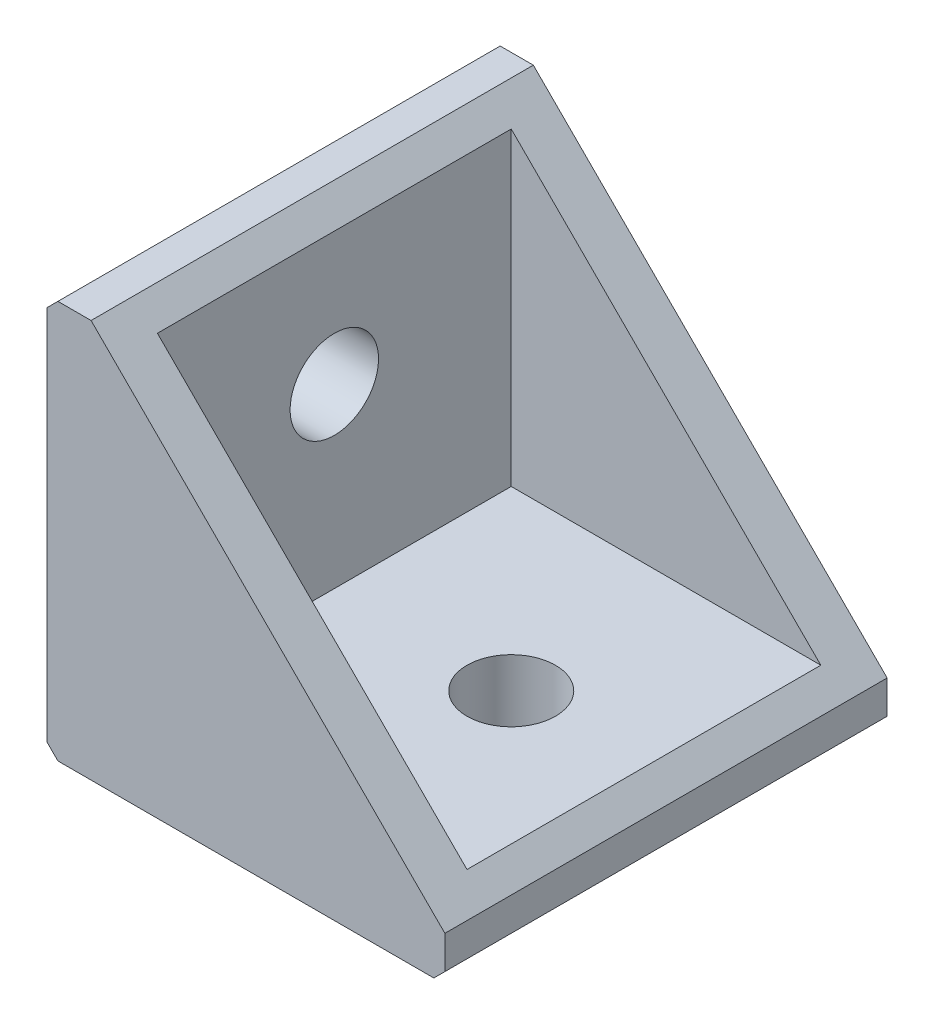
ISO-10303-21;
HEADER;
FILE_DESCRIPTION(('STEP AP214'),'2;1');
FILE_NAME('part.step','',(''),(''),'','','');
FILE_SCHEMA(('AUTOMOTIVE_DESIGN { 1 0 10303 214 1 1 1 1 }'));
ENDSEC;
DATA;
#1=APPLICATION_CONTEXT('core data for automotive mechanical design processes');
#2=APPLICATION_PROTOCOL_DEFINITION('international standard','automotive_design',2000,#1);
#3=PRODUCT_CONTEXT('',#1,'mechanical');
#4=PRODUCT('Part','Part','',(#3));
#5=PRODUCT_RELATED_PRODUCT_CATEGORY('part','',(#4));
#6=PRODUCT_DEFINITION_FORMATION('','',#4);
#7=PRODUCT_DEFINITION_CONTEXT('part definition',#1,'design');
#8=PRODUCT_DEFINITION('design','',#6,#7);
#9=PRODUCT_DEFINITION_SHAPE('','',#8);
#10=(LENGTH_UNIT() NAMED_UNIT(*) SI_UNIT(.MILLI.,.METRE.));
#11=(NAMED_UNIT(*) PLANE_ANGLE_UNIT() SI_UNIT($,.RADIAN.));
#12=(NAMED_UNIT(*) SI_UNIT($,.STERADIAN.) SOLID_ANGLE_UNIT());
#13=UNCERTAINTY_MEASURE_WITH_UNIT(LENGTH_MEASURE(1.E-05),#10,'distance_accuracy_value','');
#14=(GEOMETRIC_REPRESENTATION_CONTEXT(3) GLOBAL_UNCERTAINTY_ASSIGNED_CONTEXT((#13)) GLOBAL_UNIT_ASSIGNED_CONTEXT((#10,
#11,#12)) REPRESENTATION_CONTEXT('',''));
#15=CARTESIAN_POINT('',(0.,0.,0.));
#16=DIRECTION('',(0.,0.,1.));
#17=DIRECTION('',(1.,0.,0.));
#18=AXIS2_PLACEMENT_3D('',#15,#16,#17);
#19=CARTESIAN_POINT('',(2.,18.,0.));
#20=DIRECTION('',(-0.707106781186548,-0.707106781186548,0.));
#21=DIRECTION('',(0.707106781186548,-0.707106781186548,0.));
#22=AXIS2_PLACEMENT_3D('',#19,#20,#21);
#23=PLANE('',#22);
#24=DIRECTION('',(0.707106781186548,-0.707106781186548,0.));
#25=VECTOR('',#24,1.);
#26=CARTESIAN_POINT('',(2.,18.,20.));
#27=LINE('',#26,#25);
#28=CARTESIAN_POINT('',(2.,18.,20.));
#29=VERTEX_POINT('',#28);
#30=CARTESIAN_POINT('',(18.,2.,20.));
#31=VERTEX_POINT('',#30);
#32=EDGE_CURVE('E148',#29,#31,#27,.T.);
#33=ORIENTED_EDGE('',*,*,#32,.T.);
#34=DIRECTION('',(0.,0.,1.));
#35=VECTOR('',#34,1.);
#36=CARTESIAN_POINT('',(18.,2.,0.));
#37=LINE('',#36,#35);
#38=CARTESIAN_POINT('',(18.,1.99999999999999,0.));
#39=VERTEX_POINT('',#38);
#40=EDGE_CURVE('E151',#39,#31,#37,.T.);
#41=ORIENTED_EDGE('',*,*,#40,.F.);
#42=DIRECTION('',(0.707106781186548,-0.707106781186548,0.));
#43=VECTOR('',#42,1.);
#44=CARTESIAN_POINT('',(2.,18.,0.));
#45=LINE('',#44,#43);
#46=CARTESIAN_POINT('',(2.,18.,0.));
#47=VERTEX_POINT('',#46);
#48=EDGE_CURVE('E144',#47,#39,#45,.T.);
#49=ORIENTED_EDGE('',*,*,#48,.F.);
#50=DIRECTION('',(0.,0.,1.));
#51=VECTOR('',#50,1.);
#52=CARTESIAN_POINT('',(2.,18.,0.));
#53=LINE('',#52,#51);
#54=EDGE_CURVE('E147',#47,#29,#53,.T.);
#55=ORIENTED_EDGE('',*,*,#54,.T.);
#56=EDGE_LOOP('',(#33,#41,#49,#55));
#57=FACE_BOUND('',#56,.T.);
#58=DIRECTION('',(-0.707106781186547,0.707106781186548,0.));
#59=VECTOR('',#58,1.);
#60=CARTESIAN_POINT('',(17.,3.,2.));
#61=LINE('',#60,#59);
#62=CARTESIAN_POINT('',(17.,3.,2.));
#63=VERTEX_POINT('',#62);
#64=CARTESIAN_POINT('',(3.,17.,2.));
#65=VERTEX_POINT('',#64);
#66=EDGE_CURVE('E129',#63,#65,#61,.T.);
#67=ORIENTED_EDGE('',*,*,#66,.F.);
#68=DIRECTION('',(0.,0.,1.));
#69=VECTOR('',#68,1.);
#70=CARTESIAN_POINT('',(17.,3.,2.));
#71=LINE('',#70,#69);
#72=CARTESIAN_POINT('',(17.,3.,18.));
#73=VERTEX_POINT('',#72);
#74=EDGE_CURVE('E139',#63,#73,#71,.T.);
#75=ORIENTED_EDGE('',*,*,#74,.T.);
#76=DIRECTION('',(-0.707106781186547,0.707106781186548,0.));
#77=VECTOR('',#76,1.);
#78=CARTESIAN_POINT('',(17.,3.,18.));
#79=LINE('',#78,#77);
#80=CARTESIAN_POINT('',(3.,17.,18.));
#81=VERTEX_POINT('',#80);
#82=EDGE_CURVE('E137',#73,#81,#79,.T.);
#83=ORIENTED_EDGE('',*,*,#82,.T.);
#84=DIRECTION('',(0.,0.,1.));
#85=VECTOR('',#84,1.);
#86=CARTESIAN_POINT('',(3.,17.,2.));
#87=LINE('',#86,#85);
#88=EDGE_CURVE('E122',#65,#81,#87,.T.);
#89=ORIENTED_EDGE('',*,*,#88,.F.);
#90=EDGE_LOOP('',(#67,#75,#83,#89));
#91=FACE_BOUND('',#90,.T.);
#92=ADVANCED_FACE('F33',(#57,#91),#23,.F.);
#93=CARTESIAN_POINT('',(0.,0.,20.));
#94=DIRECTION('',(1.,0.,0.));
#95=DIRECTION('',(0.,0.,-1.));
#96=AXIS2_PLACEMENT_3D('',#93,#94,#95);
#97=PLANE('',#96);
#98=CARTESIAN_POINT('',(0.,11.,10.));
#99=DIRECTION('',(1.,0.,0.));
#100=DIRECTION('',(0.,1.,0.));
#101=AXIS2_PLACEMENT_3D('',#98,#99,#100);
#102=CIRCLE('',#101,2.);
#103=CARTESIAN_POINT('',(0.,13.,10.));
#104=VERTEX_POINT('',#103);
#105=EDGE_CURVE('E266',#104,#104,#102,.T.);
#106=ORIENTED_EDGE('',*,*,#105,.T.);
#107=EDGE_LOOP('',(#106));
#108=FACE_BOUND('',#107,.T.);
#109=DIRECTION('',(0.,-1.,0.));
#110=VECTOR('',#109,1.);
#111=CARTESIAN_POINT('',(0.,0.,0.));
#112=LINE('',#111,#110);
#113=CARTESIAN_POINT('',(0.,17.5,0.));
#114=VERTEX_POINT('',#113);
#115=CARTESIAN_POINT('',(0.,0.500000000000011,0.));
#116=VERTEX_POINT('',#115);
#117=EDGE_CURVE('E154',#114,#116,#112,.T.);
#118=ORIENTED_EDGE('',*,*,#117,.T.);
#119=DIRECTION('',(0.,0.,1.));
#120=VECTOR('',#119,1.);
#121=CARTESIAN_POINT('',(0.,0.500000000000011,20.));
#122=LINE('',#121,#120);
#123=CARTESIAN_POINT('',(0.,0.500000000000011,20.));
#124=VERTEX_POINT('',#123);
#125=EDGE_CURVE('E188',#116,#124,#122,.T.);
#126=ORIENTED_EDGE('',*,*,#125,.T.);
#127=DIRECTION('',(0.,-1.,0.));
#128=VECTOR('',#127,1.);
#129=CARTESIAN_POINT('',(0.,0.,20.));
#130=LINE('',#129,#128);
#131=CARTESIAN_POINT('',(0.,17.5,20.));
#132=VERTEX_POINT('',#131);
#133=EDGE_CURVE('E156',#132,#124,#130,.T.);
#134=ORIENTED_EDGE('',*,*,#133,.F.);
#135=DIRECTION('',(0.,0.,-1.));
#136=VECTOR('',#135,1.);
#137=CARTESIAN_POINT('',(0.,17.5,20.));
#138=LINE('',#137,#136);
#139=EDGE_CURVE('E185',#132,#114,#138,.T.);
#140=ORIENTED_EDGE('',*,*,#139,.T.);
#141=EDGE_LOOP('',(#118,#126,#134,#140));
#142=FACE_BOUND('',#141,.T.);
#143=ADVANCED_FACE('F216',(#108,#142),#97,.F.);
#144=CARTESIAN_POINT('',(0.,0.,20.));
#145=DIRECTION('',(0.,1.,0.));
#146=DIRECTION('',(0.,0.,1.));
#147=AXIS2_PLACEMENT_3D('',#144,#145,#146);
#148=PLANE('',#147);
#149=CARTESIAN_POINT('',(11.,0.,10.));
#150=DIRECTION('',(0.,1.,0.));
#151=DIRECTION('',(0.,0.,1.));
#152=AXIS2_PLACEMENT_3D('',#149,#150,#151);
#153=CIRCLE('',#152,2.);
#154=CARTESIAN_POINT('',(11.,0.,12.));
#155=VERTEX_POINT('',#154);
#156=EDGE_CURVE('E260',#155,#155,#153,.T.);
#157=ORIENTED_EDGE('',*,*,#156,.T.);
#158=EDGE_LOOP('',(#157));
#159=FACE_BOUND('',#158,.T.);
#160=DIRECTION('',(1.,0.,0.));
#161=VECTOR('',#160,1.);
#162=CARTESIAN_POINT('',(0.,0.,20.));
#163=LINE('',#162,#161);
#164=CARTESIAN_POINT('',(0.500000000000007,0.,20.));
#165=VERTEX_POINT('',#164);
#166=CARTESIAN_POINT('',(17.5,0.,20.));
#167=VERTEX_POINT('',#166);
#168=EDGE_CURVE('E159',#165,#167,#163,.T.);
#169=ORIENTED_EDGE('',*,*,#168,.F.);
#170=DIRECTION('',(0.,0.,-1.));
#171=VECTOR('',#170,1.);
#172=CARTESIAN_POINT('',(0.500000000000007,0.,20.));
#173=LINE('',#172,#171);
#174=CARTESIAN_POINT('',(0.500000000000007,0.,0.));
#175=VERTEX_POINT('',#174);
#176=EDGE_CURVE('E176',#165,#175,#173,.T.);
#177=ORIENTED_EDGE('',*,*,#176,.T.);
#178=DIRECTION('',(1.,0.,0.));
#179=VECTOR('',#178,1.);
#180=CARTESIAN_POINT('',(0.,0.,0.));
#181=LINE('',#180,#179);
#182=CARTESIAN_POINT('',(17.5,0.,0.));
#183=VERTEX_POINT('',#182);
#184=EDGE_CURVE('E169',#175,#183,#181,.T.);
#185=ORIENTED_EDGE('',*,*,#184,.T.);
#186=DIRECTION('',(0.,0.,1.));
#187=VECTOR('',#186,1.);
#188=CARTESIAN_POINT('',(17.5,0.,20.));
#189=LINE('',#188,#187);
#190=EDGE_CURVE('E166',#183,#167,#189,.T.);
#191=ORIENTED_EDGE('',*,*,#190,.T.);
#192=EDGE_LOOP('',(#169,#177,#185,#191));
#193=FACE_BOUND('',#192,.T.);
#194=ADVANCED_FACE('F224',(#159,#193),#148,.F.);
#195=CARTESIAN_POINT('',(18.,0.,20.));
#196=DIRECTION('',(-1.,0.,0.));
#197=DIRECTION('',(0.,0.,1.));
#198=AXIS2_PLACEMENT_3D('',#195,#196,#197);
#199=PLANE('',#198);
#200=DIRECTION('',(0.,1.,0.));
#201=VECTOR('',#200,1.);
#202=CARTESIAN_POINT('',(18.,0.,20.));
#203=LINE('',#202,#201);
#204=CARTESIAN_POINT('',(18.,0.500000000000007,20.));
#205=VERTEX_POINT('',#204);
#206=EDGE_CURVE('E162',#205,#31,#203,.T.);
#207=ORIENTED_EDGE('',*,*,#206,.F.);
#208=DIRECTION('',(0.,0.,-1.));
#209=VECTOR('',#208,1.);
#210=CARTESIAN_POINT('',(18.,0.500000000000007,20.));
#211=LINE('',#210,#209);
#212=CARTESIAN_POINT('',(18.,0.500000000000011,0.));
#213=VERTEX_POINT('',#212);
#214=EDGE_CURVE('E41',#205,#213,#211,.T.);
#215=ORIENTED_EDGE('',*,*,#214,.T.);
#216=DIRECTION('',(0.,1.,0.));
#217=VECTOR('',#216,1.);
#218=CARTESIAN_POINT('',(18.,0.,0.));
#219=LINE('',#218,#217);
#220=EDGE_CURVE('E172',#213,#39,#219,.T.);
#221=ORIENTED_EDGE('',*,*,#220,.T.);
#222=ORIENTED_EDGE('',*,*,#40,.T.);
#223=EDGE_LOOP('',(#207,#215,#221,#222));
#224=FACE_BOUND('',#223,.T.);
#225=ADVANCED_FACE('F198',(#224),#199,.F.);
#226=CARTESIAN_POINT('',(0.,18.,20.));
#227=DIRECTION('',(0.,-1.,0.));
#228=DIRECTION('',(0.,0.,-1.));
#229=AXIS2_PLACEMENT_3D('',#226,#227,#228);
#230=PLANE('',#229);
#231=DIRECTION('',(-1.,0.,0.));
#232=VECTOR('',#231,1.);
#233=CARTESIAN_POINT('',(0.,18.,0.));
#234=LINE('',#233,#232);
#235=CARTESIAN_POINT('',(0.500000000000004,18.,0.));
#236=VERTEX_POINT('',#235);
#237=EDGE_CURVE('E160',#47,#236,#234,.T.);
#238=ORIENTED_EDGE('',*,*,#237,.T.);
#239=DIRECTION('',(0.,0.,1.));
#240=VECTOR('',#239,1.);
#241=CARTESIAN_POINT('',(0.500000000000004,18.,20.));
#242=LINE('',#241,#240);
#243=CARTESIAN_POINT('',(0.500000000000004,18.,20.));
#244=VERTEX_POINT('',#243);
#245=EDGE_CURVE('E11',#236,#244,#242,.T.);
#246=ORIENTED_EDGE('',*,*,#245,.T.);
#247=DIRECTION('',(-1.,0.,0.));
#248=VECTOR('',#247,1.);
#249=CARTESIAN_POINT('',(0.,18.,20.));
#250=LINE('',#249,#248);
#251=EDGE_CURVE('E164',#29,#244,#250,.T.);
#252=ORIENTED_EDGE('',*,*,#251,.F.);
#253=ORIENTED_EDGE('',*,*,#54,.F.);
#254=EDGE_LOOP('',(#238,#246,#252,#253));
#255=FACE_BOUND('',#254,.T.);
#256=ADVANCED_FACE('F208',(#255),#230,.F.);
#257=CARTESIAN_POINT('',(0.,0.,20.));
#258=DIRECTION('',(0.,0.,-1.));
#259=DIRECTION('',(-1.,0.,0.));
#260=AXIS2_PLACEMENT_3D('',#257,#258,#259);
#261=PLANE('',#260);
#262=ORIENTED_EDGE('',*,*,#133,.T.);
#263=DIRECTION('',(-0.707106781186545,0.70710678118655,0.));
#264=VECTOR('',#263,1.);
#265=CARTESIAN_POINT('',(0.500000000000007,0.,20.));
#266=LINE('',#265,#264);
#267=EDGE_CURVE('E193',#124,#165,#266,.F.);
#268=ORIENTED_EDGE('',*,*,#267,.T.);
#269=ORIENTED_EDGE('',*,*,#168,.T.);
#270=DIRECTION('',(-0.70710678118655,-0.707106781186545,0.));
#271=VECTOR('',#270,1.);
#272=CARTESIAN_POINT('',(18.,0.500000000000007,20.));
#273=LINE('',#272,#271);
#274=EDGE_CURVE('E54',#167,#205,#273,.F.);
#275=ORIENTED_EDGE('',*,*,#274,.T.);
#276=ORIENTED_EDGE('',*,*,#206,.T.);
#277=ORIENTED_EDGE('',*,*,#32,.F.);
#278=ORIENTED_EDGE('',*,*,#251,.T.);
#279=DIRECTION('',(0.707106781186552,0.707106781186543,0.));
#280=VECTOR('',#279,1.);
#281=CARTESIAN_POINT('',(0.,17.5,20.));
#282=LINE('',#281,#280);
#283=EDGE_CURVE('E190',#244,#132,#282,.F.);
#284=ORIENTED_EDGE('',*,*,#283,.T.);
#285=EDGE_LOOP('',(#262,#268,#269,#275,#276,#277,#278,#284));
#286=FACE_BOUND('',#285,.T.);
#287=ADVANCED_FACE('F210',(#286),#261,.F.);
#288=CARTESIAN_POINT('',(0.,0.,0.));
#289=DIRECTION('',(0.,0.,-1.));
#290=DIRECTION('',(-1.,0.,0.));
#291=AXIS2_PLACEMENT_3D('',#288,#289,#290);
#292=PLANE('',#291);
#293=ORIENTED_EDGE('',*,*,#184,.F.);
#294=DIRECTION('',(0.707106781186545,-0.70710678118655,0.));
#295=VECTOR('',#294,1.);
#296=CARTESIAN_POINT('',(0.250000000000005,0.250000000000004,0.));
#297=LINE('',#296,#295);
#298=EDGE_CURVE('E183',#175,#116,#297,.F.);
#299=ORIENTED_EDGE('',*,*,#298,.T.);
#300=ORIENTED_EDGE('',*,*,#117,.F.);
#301=DIRECTION('',(-0.707106781186552,-0.707106781186543,0.));
#302=VECTOR('',#301,1.);
#303=CARTESIAN_POINT('',(-8.75,8.75000000000012,0.));
#304=LINE('',#303,#302);
#305=EDGE_CURVE('E179',#114,#236,#304,.F.);
#306=ORIENTED_EDGE('',*,*,#305,.T.);
#307=ORIENTED_EDGE('',*,*,#237,.F.);
#308=ORIENTED_EDGE('',*,*,#48,.T.);
#309=ORIENTED_EDGE('',*,*,#220,.F.);
#310=DIRECTION('',(0.70710678118655,0.707106781186545,0.));
#311=VECTOR('',#310,1.);
#312=CARTESIAN_POINT('',(8.74999999999993,-8.74999999999999,0.));
#313=LINE('',#312,#311);
#314=EDGE_CURVE('E181',#213,#183,#313,.F.);
#315=ORIENTED_EDGE('',*,*,#314,.T.);
#316=EDGE_LOOP('',(#293,#299,#300,#306,#307,#308,#309,#315));
#317=FACE_BOUND('',#316,.T.);
#318=ADVANCED_FACE('F203',(#317),#292,.T.);
#319=CARTESIAN_POINT('',(3.,3.,2.));
#320=DIRECTION('',(0.,-1.,0.));
#321=DIRECTION('',(0.,0.,-1.));
#322=AXIS2_PLACEMENT_3D('',#319,#320,#321);
#323=PLANE('',#322);
#324=CARTESIAN_POINT('',(11.,3.,10.));
#325=DIRECTION('',(0.,1.,0.));
#326=DIRECTION('',(0.,0.,1.));
#327=AXIS2_PLACEMENT_3D('',#324,#325,#326);
#328=CIRCLE('',#327,2.);
#329=CARTESIAN_POINT('',(11.,3.,12.));
#330=VERTEX_POINT('',#329);
#331=EDGE_CURVE('E263',#330,#330,#328,.T.);
#332=ORIENTED_EDGE('',*,*,#331,.F.);
#333=EDGE_LOOP('',(#332));
#334=FACE_BOUND('',#333,.T.);
#335=DIRECTION('',(1.,0.,0.));
#336=VECTOR('',#335,1.);
#337=CARTESIAN_POINT('',(3.,3.,18.));
#338=LINE('',#337,#336);
#339=CARTESIAN_POINT('',(3.,3.,18.));
#340=VERTEX_POINT('',#339);
#341=EDGE_CURVE('E135',#340,#73,#338,.T.);
#342=ORIENTED_EDGE('',*,*,#341,.T.);
#343=ORIENTED_EDGE('',*,*,#74,.F.);
#344=DIRECTION('',(1.,0.,0.));
#345=VECTOR('',#344,1.);
#346=CARTESIAN_POINT('',(3.,3.,2.));
#347=LINE('',#346,#345);
#348=CARTESIAN_POINT('',(3.,3.,2.));
#349=VERTEX_POINT('',#348);
#350=EDGE_CURVE('E128',#349,#63,#347,.T.);
#351=ORIENTED_EDGE('',*,*,#350,.F.);
#352=DIRECTION('',(0.,0.,1.));
#353=VECTOR('',#352,1.);
#354=CARTESIAN_POINT('',(3.,3.,2.));
#355=LINE('',#354,#353);
#356=EDGE_CURVE('E124',#349,#340,#355,.T.);
#357=ORIENTED_EDGE('',*,*,#356,.T.);
#358=EDGE_LOOP('',(#342,#343,#351,#357));
#359=FACE_BOUND('',#358,.T.);
#360=ADVANCED_FACE('F249',(#334,#359),#323,.F.);
#361=CARTESIAN_POINT('',(3.,17.,2.));
#362=DIRECTION('',(-1.,0.,0.));
#363=DIRECTION('',(0.,-1.,0.));
#364=AXIS2_PLACEMENT_3D('',#361,#362,#363);
#365=PLANE('',#364);
#366=CARTESIAN_POINT('',(3.,11.,10.));
#367=DIRECTION('',(1.,0.,0.));
#368=DIRECTION('',(0.,1.,0.));
#369=AXIS2_PLACEMENT_3D('',#366,#367,#368);
#370=CIRCLE('',#369,2.);
#371=CARTESIAN_POINT('',(3.,13.,10.));
#372=VERTEX_POINT('',#371);
#373=EDGE_CURVE('E262',#372,#372,#370,.T.);
#374=ORIENTED_EDGE('',*,*,#373,.F.);
#375=EDGE_LOOP('',(#374));
#376=FACE_BOUND('',#375,.T.);
#377=DIRECTION('',(0.,-1.,0.));
#378=VECTOR('',#377,1.);
#379=CARTESIAN_POINT('',(3.,17.,18.));
#380=LINE('',#379,#378);
#381=EDGE_CURVE('E274',#81,#340,#380,.T.);
#382=ORIENTED_EDGE('',*,*,#381,.T.);
#383=ORIENTED_EDGE('',*,*,#356,.F.);
#384=DIRECTION('',(0.,-1.,0.));
#385=VECTOR('',#384,1.);
#386=CARTESIAN_POINT('',(3.,17.,2.));
#387=LINE('',#386,#385);
#388=EDGE_CURVE('E117',#65,#349,#387,.T.);
#389=ORIENTED_EDGE('',*,*,#388,.F.);
#390=ORIENTED_EDGE('',*,*,#88,.T.);
#391=EDGE_LOOP('',(#382,#383,#389,#390));
#392=FACE_BOUND('',#391,.T.);
#393=ADVANCED_FACE('F120',(#376,#392),#365,.F.);
#394=CARTESIAN_POINT('',(0.,0.,2.));
#395=DIRECTION('',(0.,0.,1.));
#396=DIRECTION('',(1.,0.,0.));
#397=AXIS2_PLACEMENT_3D('',#394,#395,#396);
#398=PLANE('',#397);
#399=ORIENTED_EDGE('',*,*,#66,.T.);
#400=ORIENTED_EDGE('',*,*,#388,.T.);
#401=ORIENTED_EDGE('',*,*,#350,.T.);
#402=EDGE_LOOP('',(#399,#400,#401));
#403=FACE_BOUND('',#402,.T.);
#404=ADVANCED_FACE('F132',(#403),#398,.T.);
#405=CARTESIAN_POINT('',(0.,0.,18.));
#406=DIRECTION('',(0.,0.,1.));
#407=DIRECTION('',(1.,0.,0.));
#408=AXIS2_PLACEMENT_3D('',#405,#406,#407);
#409=PLANE('',#408);
#410=ORIENTED_EDGE('',*,*,#82,.F.);
#411=ORIENTED_EDGE('',*,*,#341,.F.);
#412=ORIENTED_EDGE('',*,*,#381,.F.);
#413=EDGE_LOOP('',(#410,#411,#412));
#414=FACE_BOUND('',#413,.T.);
#415=ADVANCED_FACE('F233',(#414),#409,.F.);
#416=CARTESIAN_POINT('',(0.500000000000007,0.,20.));
#417=DIRECTION('',(0.70710678118655,0.707106781186545,0.));
#418=DIRECTION('',(0.,0.,-1.));
#419=AXIS2_PLACEMENT_3D('',#416,#417,#418);
#420=PLANE('',#419);
#421=ORIENTED_EDGE('',*,*,#267,.F.);
#422=ORIENTED_EDGE('',*,*,#125,.F.);
#423=ORIENTED_EDGE('',*,*,#298,.F.);
#424=ORIENTED_EDGE('',*,*,#176,.F.);
#425=EDGE_LOOP('',(#421,#422,#423,#424));
#426=FACE_BOUND('',#425,.T.);
#427=ADVANCED_FACE('F221',(#426),#420,.F.);
#428=CARTESIAN_POINT('',(18.,0.500000000000007,20.));
#429=DIRECTION('',(-0.707106781186545,0.70710678118655,0.));
#430=DIRECTION('',(0.,0.,-1.));
#431=AXIS2_PLACEMENT_3D('',#428,#429,#430);
#432=PLANE('',#431);
#433=ORIENTED_EDGE('',*,*,#274,.F.);
#434=ORIENTED_EDGE('',*,*,#190,.F.);
#435=ORIENTED_EDGE('',*,*,#314,.F.);
#436=ORIENTED_EDGE('',*,*,#214,.F.);
#437=EDGE_LOOP('',(#433,#434,#435,#436));
#438=FACE_BOUND('',#437,.T.);
#439=ADVANCED_FACE('F226',(#438),#432,.F.);
#440=CARTESIAN_POINT('',(0.,17.5,20.));
#441=DIRECTION('',(0.707106781186543,-0.707106781186552,0.));
#442=DIRECTION('',(0.,0.,-1.));
#443=AXIS2_PLACEMENT_3D('',#440,#441,#442);
#444=PLANE('',#443);
#445=ORIENTED_EDGE('',*,*,#283,.F.);
#446=ORIENTED_EDGE('',*,*,#245,.F.);
#447=ORIENTED_EDGE('',*,*,#305,.F.);
#448=ORIENTED_EDGE('',*,*,#139,.F.);
#449=EDGE_LOOP('',(#445,#446,#447,#448));
#450=FACE_BOUND('',#449,.T.);
#451=ADVANCED_FACE('F35',(#450),#444,.F.);
#452=CARTESIAN_POINT('',(0.,11.,10.));
#453=DIRECTION('',(1.,0.,0.));
#454=DIRECTION('',(0.,1.,0.));
#455=AXIS2_PLACEMENT_3D('',#452,#453,#454);
#456=CYLINDRICAL_SURFACE('',#455,2.);
#457=ORIENTED_EDGE('',*,*,#105,.F.);
#458=EDGE_LOOP('',(#457));
#459=FACE_BOUND('',#458,.T.);
#460=ORIENTED_EDGE('',*,*,#373,.T.);
#461=EDGE_LOOP('',(#460));
#462=FACE_BOUND('',#461,.T.);
#463=ADVANCED_FACE('F232',(#459,#462),#456,.F.);
#464=CARTESIAN_POINT('',(11.,0.,10.));
#465=DIRECTION('',(0.,1.,0.));
#466=DIRECTION('',(0.,0.,1.));
#467=AXIS2_PLACEMENT_3D('',#464,#465,#466);
#468=CYLINDRICAL_SURFACE('',#467,2.);
#469=ORIENTED_EDGE('',*,*,#156,.F.);
#470=EDGE_LOOP('',(#469));
#471=FACE_BOUND('',#470,.T.);
#472=ORIENTED_EDGE('',*,*,#331,.T.);
#473=EDGE_LOOP('',(#472));
#474=FACE_BOUND('',#473,.T.);
#475=ADVANCED_FACE('F295',(#471,#474),#468,.F.);
#476=CLOSED_SHELL('',(#92,#143,#194,#225,#256,#287,#318,#360,#393,#404,#415,#427,#439,#451,#463,#475));
#477=MANIFOLD_SOLID_BREP('B2',#476);
#478=ADVANCED_BREP_SHAPE_REPRESENTATION('',(#18,#477),#14);
#479=SHAPE_DEFINITION_REPRESENTATION(#9,#478);
ENDSEC;
END-ISO-10303-21;
